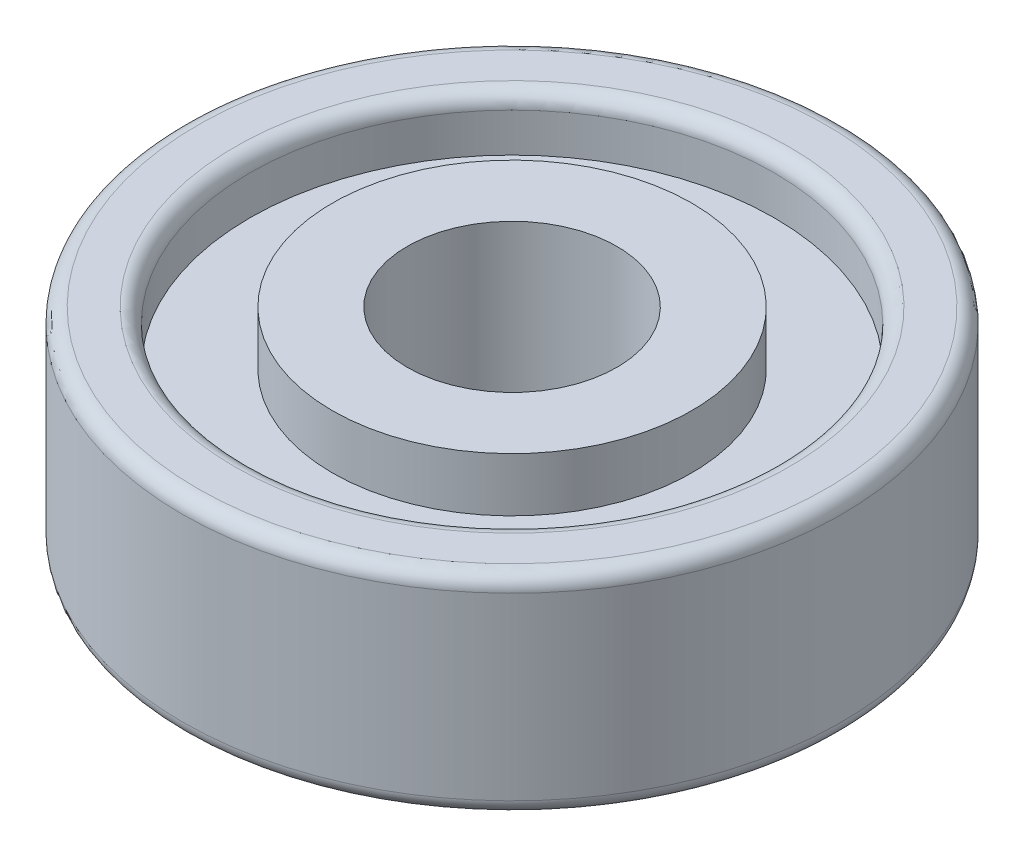
ISO-10303-21;
HEADER;
FILE_DESCRIPTION(('STEP AP214'),'2;1');
FILE_NAME('part.step','',(''),(''),'','','');
FILE_SCHEMA(('AUTOMOTIVE_DESIGN { 1 0 10303 214 1 1 1 1 }'));
ENDSEC;
DATA;
#1=APPLICATION_CONTEXT('core data for automotive mechanical design processes');
#2=APPLICATION_PROTOCOL_DEFINITION('international standard','automotive_design',2000,#1);
#3=PRODUCT_CONTEXT('',#1,'mechanical');
#4=PRODUCT('Part','Part','',(#3));
#5=PRODUCT_RELATED_PRODUCT_CATEGORY('part','',(#4));
#6=PRODUCT_DEFINITION_FORMATION('','',#4);
#7=PRODUCT_DEFINITION_CONTEXT('part definition',#1,'design');
#8=PRODUCT_DEFINITION('design','',#6,#7);
#9=PRODUCT_DEFINITION_SHAPE('','',#8);
#10=(LENGTH_UNIT() NAMED_UNIT(*) SI_UNIT(.MILLI.,.METRE.));
#11=(NAMED_UNIT(*) PLANE_ANGLE_UNIT() SI_UNIT($,.RADIAN.));
#12=(NAMED_UNIT(*) SI_UNIT($,.STERADIAN.) SOLID_ANGLE_UNIT());
#13=UNCERTAINTY_MEASURE_WITH_UNIT(LENGTH_MEASURE(1.E-05),#10,'distance_accuracy_value','');
#14=(GEOMETRIC_REPRESENTATION_CONTEXT(3) GLOBAL_UNCERTAINTY_ASSIGNED_CONTEXT((#13)) GLOBAL_UNIT_ASSIGNED_CONTEXT((#10,
#11,#12)) REPRESENTATION_CONTEXT('',''));
#15=CARTESIAN_POINT('',(0.,0.,0.));
#16=DIRECTION('',(0.,0.,1.));
#17=DIRECTION('',(1.,0.,0.));
#18=AXIS2_PLACEMENT_3D('',#15,#16,#17);
#19=CARTESIAN_POINT('',(0.,-3.5,0.));
#20=DIRECTION('',(0.,1.,0.));
#21=DIRECTION('',(0.,0.,1.));
#22=AXIS2_PLACEMENT_3D('',#19,#20,#21);
#23=PLANE('',#22);
#24=CARTESIAN_POINT('',(0.,-3.5,0.));
#25=DIRECTION('',(0.,1.,0.));
#26=DIRECTION('',(0.,0.,1.));
#27=AXIS2_PLACEMENT_3D('',#24,#25,#26);
#28=CIRCLE('',#27,3.5);
#29=CARTESIAN_POINT('',(0.,-3.5,3.5));
#30=VERTEX_POINT('',#29);
#31=EDGE_CURVE('E89',#30,#30,#28,.T.);
#32=ORIENTED_EDGE('',*,*,#31,.T.);
#33=EDGE_LOOP('',(#32));
#34=FACE_BOUND('',#33,.T.);
#35=CARTESIAN_POINT('',(0.,-3.5,0.));
#36=DIRECTION('',(0.,1.,0.));
#37=DIRECTION('',(0.,0.,1.));
#38=AXIS2_PLACEMENT_3D('',#35,#36,#37);
#39=CIRCLE('',#38,6.);
#40=CARTESIAN_POINT('',(0.,-3.5,6.));
#41=VERTEX_POINT('',#40);
#42=EDGE_CURVE('E114',#41,#41,#39,.T.);
#43=ORIENTED_EDGE('',*,*,#42,.F.);
#44=EDGE_LOOP('',(#43));
#45=FACE_BOUND('',#44,.T.);
#46=ADVANCED_FACE('F49',(#34,#45),#23,.F.);
#47=CARTESIAN_POINT('',(0.,3.5,0.));
#48=DIRECTION('',(0.,1.,0.));
#49=DIRECTION('',(0.,0.,1.));
#50=AXIS2_PLACEMENT_3D('',#47,#48,#49);
#51=PLANE('',#50);
#52=CARTESIAN_POINT('',(0.,3.5,0.));
#53=DIRECTION('',(0.,1.,0.));
#54=DIRECTION('',(0.,0.,1.));
#55=AXIS2_PLACEMENT_3D('',#52,#53,#54);
#56=CIRCLE('',#55,3.5);
#57=CARTESIAN_POINT('',(0.,3.5,3.5));
#58=VERTEX_POINT('',#57);
#59=EDGE_CURVE('E90',#58,#58,#56,.T.);
#60=ORIENTED_EDGE('',*,*,#59,.F.);
#61=EDGE_LOOP('',(#60));
#62=FACE_BOUND('',#61,.T.);
#63=CARTESIAN_POINT('',(0.,3.5,0.));
#64=DIRECTION('',(0.,1.,0.));
#65=DIRECTION('',(0.,0.,1.));
#66=AXIS2_PLACEMENT_3D('',#63,#64,#65);
#67=CIRCLE('',#66,6.);
#68=CARTESIAN_POINT('',(0.,3.5,6.));
#69=VERTEX_POINT('',#68);
#70=EDGE_CURVE('E102',#69,#69,#67,.T.);
#71=ORIENTED_EDGE('',*,*,#70,.T.);
#72=EDGE_LOOP('',(#71));
#73=FACE_BOUND('',#72,.T.);
#74=ADVANCED_FACE('F133',(#62,#73),#51,.T.);
#75=CARTESIAN_POINT('',(0.,3.5,0.));
#76=DIRECTION('',(0.,-1.,0.));
#77=DIRECTION('',(0.,0.,-1.));
#78=AXIS2_PLACEMENT_3D('',#75,#76,#77);
#79=CYLINDRICAL_SURFACE('',#78,11.);
#80=CARTESIAN_POINT('',(0.,-3.,0.));
#81=DIRECTION('',(0.,1.,0.));
#82=DIRECTION('',(0.,0.,1.));
#83=AXIS2_PLACEMENT_3D('',#80,#81,#82);
#84=CIRCLE('',#83,11.);
#85=CARTESIAN_POINT('',(0.,-3.,11.));
#86=VERTEX_POINT('',#85);
#87=EDGE_CURVE('E67',#86,#86,#84,.T.);
#88=ORIENTED_EDGE('',*,*,#87,.T.);
#89=EDGE_LOOP('',(#88));
#90=FACE_BOUND('',#89,.T.);
#91=CARTESIAN_POINT('',(0.,3.,0.));
#92=DIRECTION('',(0.,1.,0.));
#93=DIRECTION('',(0.,0.,1.));
#94=AXIS2_PLACEMENT_3D('',#91,#92,#93);
#95=CIRCLE('',#94,11.);
#96=CARTESIAN_POINT('',(0.,3.,11.));
#97=VERTEX_POINT('',#96);
#98=EDGE_CURVE('E73',#97,#97,#95,.F.);
#99=ORIENTED_EDGE('',*,*,#98,.T.);
#100=EDGE_LOOP('',(#99));
#101=FACE_BOUND('',#100,.T.);
#102=ADVANCED_FACE('F140',(#90,#101),#79,.T.);
#103=CARTESIAN_POINT('',(0.,3.5,0.));
#104=DIRECTION('',(0.,1.,0.));
#105=DIRECTION('',(0.,0.,1.));
#106=AXIS2_PLACEMENT_3D('',#103,#104,#105);
#107=CIRCLE('',#106,9.25);
#108=CARTESIAN_POINT('',(0.,3.5,9.25));
#109=VERTEX_POINT('',#108);
#110=EDGE_CURVE('E11',#109,#109,#107,.F.);
#111=ORIENTED_EDGE('',*,*,#110,.T.);
#112=EDGE_LOOP('',(#111));
#113=FACE_BOUND('',#112,.T.);
#114=CARTESIAN_POINT('',(0.,3.5,0.));
#115=DIRECTION('',(0.,1.,0.));
#116=DIRECTION('',(0.,0.,1.));
#117=AXIS2_PLACEMENT_3D('',#114,#115,#116);
#118=CIRCLE('',#117,10.5);
#119=CARTESIAN_POINT('',(0.,3.5,10.5));
#120=VERTEX_POINT('',#119);
#121=EDGE_CURVE('E57',#120,#120,#118,.T.);
#122=ORIENTED_EDGE('',*,*,#121,.T.);
#123=EDGE_LOOP('',(#122));
#124=FACE_BOUND('',#123,.T.);
#125=ADVANCED_FACE('F143',(#113,#124),#51,.T.);
#126=CARTESIAN_POINT('',(0.,-3.5,0.));
#127=DIRECTION('',(0.,1.,0.));
#128=DIRECTION('',(0.,0.,1.));
#129=AXIS2_PLACEMENT_3D('',#126,#127,#128);
#130=CIRCLE('',#129,9.25);
#131=CARTESIAN_POINT('',(0.,-3.5,9.25));
#132=VERTEX_POINT('',#131);
#133=EDGE_CURVE('E81',#132,#132,#130,.T.);
#134=ORIENTED_EDGE('',*,*,#133,.T.);
#135=EDGE_LOOP('',(#134));
#136=FACE_BOUND('',#135,.T.);
#137=CARTESIAN_POINT('',(0.,-3.5,0.));
#138=DIRECTION('',(0.,1.,0.));
#139=DIRECTION('',(0.,0.,1.));
#140=AXIS2_PLACEMENT_3D('',#137,#138,#139);
#141=CIRCLE('',#140,10.5);
#142=CARTESIAN_POINT('',(0.,-3.5,10.5));
#143=VERTEX_POINT('',#142);
#144=EDGE_CURVE('E85',#143,#143,#141,.F.);
#145=ORIENTED_EDGE('',*,*,#144,.T.);
#146=EDGE_LOOP('',(#145));
#147=FACE_BOUND('',#146,.T.);
#148=ADVANCED_FACE('F136',(#136,#147),#23,.F.);
#149=CARTESIAN_POINT('',(0.,-3.5,0.));
#150=DIRECTION('',(0.,1.,0.));
#151=DIRECTION('',(0.,0.,1.));
#152=AXIS2_PLACEMENT_3D('',#149,#150,#151);
#153=CYLINDRICAL_SURFACE('',#152,3.5);
#154=ORIENTED_EDGE('',*,*,#31,.F.);
#155=EDGE_LOOP('',(#154));
#156=FACE_BOUND('',#155,.T.);
#157=ORIENTED_EDGE('',*,*,#59,.T.);
#158=EDGE_LOOP('',(#157));
#159=FACE_BOUND('',#158,.T.);
#160=ADVANCED_FACE('F146',(#156,#159),#153,.F.);
#161=CARTESIAN_POINT('',(0.,1.7,0.));
#162=DIRECTION('',(0.,1.,0.));
#163=DIRECTION('',(0.,0.,1.));
#164=AXIS2_PLACEMENT_3D('',#161,#162,#163);
#165=CYLINDRICAL_SURFACE('',#164,8.75);
#166=CARTESIAN_POINT('',(0.,3.,0.));
#167=DIRECTION('',(0.,1.,0.));
#168=DIRECTION('',(0.,0.,1.));
#169=AXIS2_PLACEMENT_3D('',#166,#167,#168);
#170=CIRCLE('',#169,8.75);
#171=CARTESIAN_POINT('',(0.,3.,8.75));
#172=VERTEX_POINT('',#171);
#173=EDGE_CURVE('E62',#172,#172,#170,.T.);
#174=ORIENTED_EDGE('',*,*,#173,.T.);
#175=EDGE_LOOP('',(#174));
#176=FACE_BOUND('',#175,.T.);
#177=CARTESIAN_POINT('',(0.,1.7,0.));
#178=DIRECTION('',(0.,1.,0.));
#179=DIRECTION('',(0.,0.,1.));
#180=AXIS2_PLACEMENT_3D('',#177,#178,#179);
#181=CIRCLE('',#180,8.75);
#182=CARTESIAN_POINT('',(0.,1.7,8.75));
#183=VERTEX_POINT('',#182);
#184=EDGE_CURVE('E94',#183,#183,#181,.T.);
#185=ORIENTED_EDGE('',*,*,#184,.F.);
#186=EDGE_LOOP('',(#185));
#187=FACE_BOUND('',#186,.T.);
#188=ADVANCED_FACE('F152',(#176,#187),#165,.F.);
#189=CARTESIAN_POINT('',(0.,1.7,0.));
#190=DIRECTION('',(0.,1.,0.));
#191=DIRECTION('',(0.,0.,1.));
#192=AXIS2_PLACEMENT_3D('',#189,#190,#191);
#193=PLANE('',#192);
#194=CARTESIAN_POINT('',(0.,1.7,0.));
#195=DIRECTION('',(0.,1.,0.));
#196=DIRECTION('',(0.,0.,1.));
#197=AXIS2_PLACEMENT_3D('',#194,#195,#196);
#198=CIRCLE('',#197,6.);
#199=CARTESIAN_POINT('',(0.,1.7,6.));
#200=VERTEX_POINT('',#199);
#201=EDGE_CURVE('E101',#200,#200,#198,.T.);
#202=ORIENTED_EDGE('',*,*,#201,.F.);
#203=EDGE_LOOP('',(#202));
#204=FACE_BOUND('',#203,.T.);
#205=ORIENTED_EDGE('',*,*,#184,.T.);
#206=EDGE_LOOP('',(#205));
#207=FACE_BOUND('',#206,.T.);
#208=ADVANCED_FACE('F198',(#204,#207),#193,.T.);
#209=CARTESIAN_POINT('',(0.,1.7,0.));
#210=DIRECTION('',(0.,1.,0.));
#211=DIRECTION('',(0.,0.,1.));
#212=AXIS2_PLACEMENT_3D('',#209,#210,#211);
#213=CYLINDRICAL_SURFACE('',#212,6.);
#214=ORIENTED_EDGE('',*,*,#201,.T.);
#215=EDGE_LOOP('',(#214));
#216=FACE_BOUND('',#215,.T.);
#217=ORIENTED_EDGE('',*,*,#70,.F.);
#218=EDGE_LOOP('',(#217));
#219=FACE_BOUND('',#218,.T.);
#220=ADVANCED_FACE('F193',(#216,#219),#213,.T.);
#221=CARTESIAN_POINT('',(0.,-1.7,0.));
#222=DIRECTION('',(0.,-1.,0.));
#223=DIRECTION('',(0.,0.,1.));
#224=AXIS2_PLACEMENT_3D('',#221,#222,#223);
#225=PLANE('',#224);
#226=CARTESIAN_POINT('',(0.,-1.7,0.));
#227=DIRECTION('',(0.,1.,0.));
#228=DIRECTION('',(0.,0.,1.));
#229=AXIS2_PLACEMENT_3D('',#226,#227,#228);
#230=CIRCLE('',#229,8.75);
#231=CARTESIAN_POINT('',(0.,-1.7,8.75));
#232=VERTEX_POINT('',#231);
#233=EDGE_CURVE('E106',#232,#232,#230,.T.);
#234=ORIENTED_EDGE('',*,*,#233,.F.);
#235=EDGE_LOOP('',(#234));
#236=FACE_BOUND('',#235,.T.);
#237=CARTESIAN_POINT('',(0.,-1.7,0.));
#238=DIRECTION('',(0.,1.,0.));
#239=DIRECTION('',(0.,0.,1.));
#240=AXIS2_PLACEMENT_3D('',#237,#238,#239);
#241=CIRCLE('',#240,6.);
#242=CARTESIAN_POINT('',(0.,-1.7,6.));
#243=VERTEX_POINT('',#242);
#244=EDGE_CURVE('E113',#243,#243,#241,.T.);
#245=ORIENTED_EDGE('',*,*,#244,.T.);
#246=EDGE_LOOP('',(#245));
#247=FACE_BOUND('',#246,.T.);
#248=ADVANCED_FACE('F122',(#236,#247),#225,.T.);
#249=CARTESIAN_POINT('',(0.,-1.7,0.));
#250=DIRECTION('',(0.,-1.,0.));
#251=DIRECTION('',(0.,0.,-1.));
#252=AXIS2_PLACEMENT_3D('',#249,#250,#251);
#253=CYLINDRICAL_SURFACE('',#252,8.75);
#254=CARTESIAN_POINT('',(0.,-3.,0.));
#255=DIRECTION('',(0.,1.,0.));
#256=DIRECTION('',(0.,0.,1.));
#257=AXIS2_PLACEMENT_3D('',#254,#255,#256);
#258=CIRCLE('',#257,8.75);
#259=CARTESIAN_POINT('',(0.,-3.,8.75));
#260=VERTEX_POINT('',#259);
#261=EDGE_CURVE('E77',#260,#260,#258,.F.);
#262=ORIENTED_EDGE('',*,*,#261,.T.);
#263=EDGE_LOOP('',(#262));
#264=FACE_BOUND('',#263,.T.);
#265=ORIENTED_EDGE('',*,*,#233,.T.);
#266=EDGE_LOOP('',(#265));
#267=FACE_BOUND('',#266,.T.);
#268=ADVANCED_FACE('F128',(#264,#267),#253,.F.);
#269=CARTESIAN_POINT('',(0.,-1.7,0.));
#270=DIRECTION('',(0.,-1.,0.));
#271=DIRECTION('',(0.,0.,-1.));
#272=AXIS2_PLACEMENT_3D('',#269,#270,#271);
#273=CYLINDRICAL_SURFACE('',#272,6.);
#274=ORIENTED_EDGE('',*,*,#244,.F.);
#275=EDGE_LOOP('',(#274));
#276=FACE_BOUND('',#275,.T.);
#277=ORIENTED_EDGE('',*,*,#42,.T.);
#278=EDGE_LOOP('',(#277));
#279=FACE_BOUND('',#278,.T.);
#280=ADVANCED_FACE('F124',(#276,#279),#273,.T.);
#281=CARTESIAN_POINT('',(0.,-3.,0.));
#282=DIRECTION('',(0.,1.,0.));
#283=DIRECTION('',(0.,0.,1.));
#284=AXIS2_PLACEMENT_3D('',#281,#282,#283);
#285=TOROIDAL_SURFACE('',#284,9.25,0.5);
#286=ORIENTED_EDGE('',*,*,#261,.F.);
#287=EDGE_LOOP('',(#286));
#288=FACE_BOUND('',#287,.T.);
#289=ORIENTED_EDGE('',*,*,#133,.F.);
#290=EDGE_LOOP('',(#289));
#291=FACE_BOUND('',#290,.T.);
#292=ADVANCED_FACE('F127',(#288,#291),#285,.T.);
#293=CARTESIAN_POINT('',(0.,-3.,0.));
#294=DIRECTION('',(0.,1.,0.));
#295=DIRECTION('',(0.,0.,1.));
#296=AXIS2_PLACEMENT_3D('',#293,#294,#295);
#297=TOROIDAL_SURFACE('',#296,10.5,0.5);
#298=ORIENTED_EDGE('',*,*,#144,.F.);
#299=EDGE_LOOP('',(#298));
#300=FACE_BOUND('',#299,.T.);
#301=ORIENTED_EDGE('',*,*,#87,.F.);
#302=EDGE_LOOP('',(#301));
#303=FACE_BOUND('',#302,.T.);
#304=ADVANCED_FACE('F159',(#300,#303),#297,.T.);
#305=CARTESIAN_POINT('',(0.,3.,0.));
#306=DIRECTION('',(0.,1.,0.));
#307=DIRECTION('',(0.,0.,1.));
#308=AXIS2_PLACEMENT_3D('',#305,#306,#307);
#309=TOROIDAL_SURFACE('',#308,9.25,0.5);
#310=ORIENTED_EDGE('',*,*,#110,.F.);
#311=EDGE_LOOP('',(#310));
#312=FACE_BOUND('',#311,.T.);
#313=ORIENTED_EDGE('',*,*,#173,.F.);
#314=EDGE_LOOP('',(#313));
#315=FACE_BOUND('',#314,.T.);
#316=ADVANCED_FACE('F162',(#312,#315),#309,.T.);
#317=CARTESIAN_POINT('',(0.,3.,0.));
#318=DIRECTION('',(0.,1.,0.));
#319=DIRECTION('',(0.,0.,1.));
#320=AXIS2_PLACEMENT_3D('',#317,#318,#319);
#321=TOROIDAL_SURFACE('',#320,10.5,0.5);
#322=ORIENTED_EDGE('',*,*,#98,.F.);
#323=EDGE_LOOP('',(#322));
#324=FACE_BOUND('',#323,.T.);
#325=ORIENTED_EDGE('',*,*,#121,.F.);
#326=EDGE_LOOP('',(#325));
#327=FACE_BOUND('',#326,.T.);
#328=ADVANCED_FACE('F51',(#324,#327),#321,.T.);
#329=CLOSED_SHELL('',(#46,#74,#102,#125,#148,#160,#188,#208,#220,#248,#268,#280,#292,#304,#316,#328));
#330=MANIFOLD_SOLID_BREP('B2',#329);
#331=ADVANCED_BREP_SHAPE_REPRESENTATION('',(#18,#330),#14);
#332=SHAPE_DEFINITION_REPRESENTATION(#9,#331);
ENDSEC;
END-ISO-10303-21;
